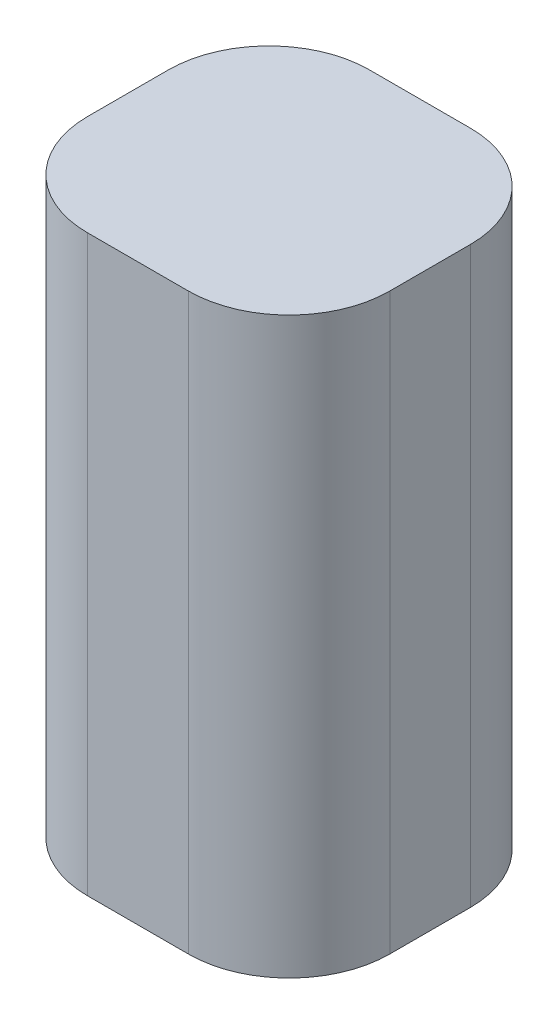
ISO-10303-21;
HEADER;
FILE_DESCRIPTION(('STEP AP214'),'2;1');
FILE_NAME('part.step','',(''),(''),'','','');
FILE_SCHEMA(('AUTOMOTIVE_DESIGN { 1 0 10303 214 1 1 1 1 }'));
ENDSEC;
DATA;
#1=APPLICATION_CONTEXT('core data for automotive mechanical design processes');
#2=APPLICATION_PROTOCOL_DEFINITION('international standard','automotive_design',2000,#1);
#3=PRODUCT_CONTEXT('',#1,'mechanical');
#4=PRODUCT('Part','Part','',(#3));
#5=PRODUCT_RELATED_PRODUCT_CATEGORY('part','',(#4));
#6=PRODUCT_DEFINITION_FORMATION('','',#4);
#7=PRODUCT_DEFINITION_CONTEXT('part definition',#1,'design');
#8=PRODUCT_DEFINITION('design','',#6,#7);
#9=PRODUCT_DEFINITION_SHAPE('','',#8);
#10=(LENGTH_UNIT() NAMED_UNIT(*) SI_UNIT(.MILLI.,.METRE.));
#11=(NAMED_UNIT(*) PLANE_ANGLE_UNIT() SI_UNIT($,.RADIAN.));
#12=(NAMED_UNIT(*) SI_UNIT($,.STERADIAN.) SOLID_ANGLE_UNIT());
#13=UNCERTAINTY_MEASURE_WITH_UNIT(LENGTH_MEASURE(1.E-05),#10,'distance_accuracy_value','');
#14=(GEOMETRIC_REPRESENTATION_CONTEXT(3) GLOBAL_UNCERTAINTY_ASSIGNED_CONTEXT((#13)) GLOBAL_UNIT_ASSIGNED_CONTEXT((#10,
#11,#12)) REPRESENTATION_CONTEXT('',''));
#15=CARTESIAN_POINT('',(0.,0.,0.));
#16=DIRECTION('',(0.,0.,1.));
#17=DIRECTION('',(1.,0.,0.));
#18=AXIS2_PLACEMENT_3D('',#15,#16,#17);
#19=CARTESIAN_POINT('',(15.,-28.5,28.));
#20=DIRECTION('',(-1.,0.,0.));
#21=DIRECTION('',(0.,0.,1.));
#22=AXIS2_PLACEMENT_3D('',#19,#20,#21);
#23=PLANE('',#22);
#24=DIRECTION('',(0.,0.,-1.));
#25=VECTOR('',#24,1.);
#26=CARTESIAN_POINT('',(15.,-28.5,28.));
#27=LINE('',#26,#25);
#28=CARTESIAN_POINT('',(15.,-28.5,18.));
#29=VERTEX_POINT('',#28);
#30=CARTESIAN_POINT('',(15.,-28.5,10.));
#31=VERTEX_POINT('',#30);
#32=EDGE_CURVE('E121',#29,#31,#27,.T.);
#33=ORIENTED_EDGE('',*,*,#32,.T.);
#34=DIRECTION('',(0.,1.,0.));
#35=VECTOR('',#34,1.);
#36=CARTESIAN_POINT('',(15.,28.5,10.));
#37=LINE('',#36,#35);
#38=CARTESIAN_POINT('',(15.,28.5,10.));
#39=VERTEX_POINT('',#38);
#40=EDGE_CURVE('E147',#31,#39,#37,.T.);
#41=ORIENTED_EDGE('',*,*,#40,.T.);
#42=DIRECTION('',(0.,0.,-1.));
#43=VECTOR('',#42,1.);
#44=CARTESIAN_POINT('',(15.,28.5,28.));
#45=LINE('',#44,#43);
#46=CARTESIAN_POINT('',(15.,28.5,18.));
#47=VERTEX_POINT('',#46);
#48=EDGE_CURVE('E126',#47,#39,#45,.T.);
#49=ORIENTED_EDGE('',*,*,#48,.F.);
#50=DIRECTION('',(0.,1.,0.));
#51=VECTOR('',#50,1.);
#52=CARTESIAN_POINT('',(15.,-28.5,18.));
#53=LINE('',#52,#51);
#54=EDGE_CURVE('E145',#47,#29,#53,.F.);
#55=ORIENTED_EDGE('',*,*,#54,.T.);
#56=EDGE_LOOP('',(#33,#41,#49,#55));
#57=FACE_BOUND('',#56,.T.);
#58=ADVANCED_FACE('F33',(#57),#23,.F.);
#59=CARTESIAN_POINT('',(-15.,28.5,28.));
#60=DIRECTION('',(0.,-1.,0.));
#61=DIRECTION('',(0.,0.,-1.));
#62=AXIS2_PLACEMENT_3D('',#59,#60,#61);
#63=PLANE('',#62);
#64=DIRECTION('',(-1.,0.,0.));
#65=VECTOR('',#64,1.);
#66=CARTESIAN_POINT('',(-15.,28.5,0.));
#67=LINE('',#66,#65);
#68=CARTESIAN_POINT('',(5.,28.5,0.));
#69=VERTEX_POINT('',#68);
#70=CARTESIAN_POINT('',(-5.,28.5,0.));
#71=VERTEX_POINT('',#70);
#72=EDGE_CURVE('E162',#69,#71,#67,.T.);
#73=ORIENTED_EDGE('',*,*,#72,.T.);
#74=CARTESIAN_POINT('',(-5.,28.5,10.));
#75=DIRECTION('',(0.,-1.,0.));
#76=DIRECTION('',(0.,0.,-1.));
#77=AXIS2_PLACEMENT_3D('',#74,#75,#76);
#78=CIRCLE('',#77,10.);
#79=CARTESIAN_POINT('',(-15.,28.5,10.));
#80=VERTEX_POINT('',#79);
#81=EDGE_CURVE('E143',#71,#80,#78,.F.);
#82=ORIENTED_EDGE('',*,*,#81,.T.);
#83=DIRECTION('',(0.,0.,-1.));
#84=VECTOR('',#83,1.);
#85=CARTESIAN_POINT('',(-15.,28.5,28.));
#86=LINE('',#85,#84);
#87=CARTESIAN_POINT('',(-15.,28.5,18.));
#88=VERTEX_POINT('',#87);
#89=EDGE_CURVE('E120',#88,#80,#86,.T.);
#90=ORIENTED_EDGE('',*,*,#89,.F.);
#91=CARTESIAN_POINT('',(-5.,28.5,18.));
#92=DIRECTION('',(0.,-1.,0.));
#93=DIRECTION('',(0.,0.,-1.));
#94=AXIS2_PLACEMENT_3D('',#91,#92,#93);
#95=CIRCLE('',#94,10.);
#96=CARTESIAN_POINT('',(-5.,28.5,28.));
#97=VERTEX_POINT('',#96);
#98=EDGE_CURVE('E125',#88,#97,#95,.F.);
#99=ORIENTED_EDGE('',*,*,#98,.T.);
#100=DIRECTION('',(-1.,0.,0.));
#101=VECTOR('',#100,1.);
#102=CARTESIAN_POINT('',(-15.,28.5,28.));
#103=LINE('',#102,#101);
#104=CARTESIAN_POINT('',(5.,28.5,28.));
#105=VERTEX_POINT('',#104);
#106=EDGE_CURVE('E153',#105,#97,#103,.T.);
#107=ORIENTED_EDGE('',*,*,#106,.F.);
#108=CARTESIAN_POINT('',(5.,28.5,18.));
#109=DIRECTION('',(0.,-1.,0.));
#110=DIRECTION('',(0.,0.,-1.));
#111=AXIS2_PLACEMENT_3D('',#108,#109,#110);
#112=CIRCLE('',#111,10.);
#113=EDGE_CURVE('E56',#105,#47,#112,.F.);
#114=ORIENTED_EDGE('',*,*,#113,.T.);
#115=ORIENTED_EDGE('',*,*,#48,.T.);
#116=CARTESIAN_POINT('',(5.,28.5,10.));
#117=DIRECTION('',(0.,-1.,0.));
#118=DIRECTION('',(0.,0.,-1.));
#119=AXIS2_PLACEMENT_3D('',#116,#117,#118);
#120=CIRCLE('',#119,10.);
#121=EDGE_CURVE('E48',#39,#69,#120,.F.);
#122=ORIENTED_EDGE('',*,*,#121,.T.);
#123=EDGE_LOOP('',(#73,#82,#90,#99,#107,#114,#115,#122));
#124=FACE_BOUND('',#123,.T.);
#125=ADVANCED_FACE('F157',(#124),#63,.F.);
#126=CARTESIAN_POINT('',(-15.,-28.5,28.));
#127=DIRECTION('',(1.,0.,0.));
#128=DIRECTION('',(0.,0.,-1.));
#129=AXIS2_PLACEMENT_3D('',#126,#127,#128);
#130=PLANE('',#129);
#131=ORIENTED_EDGE('',*,*,#89,.T.);
#132=DIRECTION('',(0.,-1.,0.));
#133=VECTOR('',#132,1.);
#134=CARTESIAN_POINT('',(-15.,-28.5,10.));
#135=LINE('',#134,#133);
#136=CARTESIAN_POINT('',(-15.,-28.5,10.));
#137=VERTEX_POINT('',#136);
#138=EDGE_CURVE('E119',#80,#137,#135,.T.);
#139=ORIENTED_EDGE('',*,*,#138,.T.);
#140=DIRECTION('',(0.,0.,-1.));
#141=VECTOR('',#140,1.);
#142=CARTESIAN_POINT('',(-15.,-28.5,28.));
#143=LINE('',#142,#141);
#144=CARTESIAN_POINT('',(-15.,-28.5,18.));
#145=VERTEX_POINT('',#144);
#146=EDGE_CURVE('E103',#145,#137,#143,.T.);
#147=ORIENTED_EDGE('',*,*,#146,.F.);
#148=DIRECTION('',(0.,-1.,0.));
#149=VECTOR('',#148,1.);
#150=CARTESIAN_POINT('',(-15.,-28.5,18.));
#151=LINE('',#150,#149);
#152=EDGE_CURVE('E116',#145,#88,#151,.F.);
#153=ORIENTED_EDGE('',*,*,#152,.T.);
#154=EDGE_LOOP('',(#131,#139,#147,#153));
#155=FACE_BOUND('',#154,.T.);
#156=ADVANCED_FACE('F115',(#155),#130,.F.);
#157=CARTESIAN_POINT('',(-15.,-28.5,28.));
#158=DIRECTION('',(0.,1.,0.));
#159=DIRECTION('',(0.,0.,1.));
#160=AXIS2_PLACEMENT_3D('',#157,#158,#159);
#161=PLANE('',#160);
#162=ORIENTED_EDGE('',*,*,#146,.T.);
#163=CARTESIAN_POINT('',(-5.,-28.5,10.));
#164=DIRECTION('',(0.,1.,0.));
#165=DIRECTION('',(0.,0.,1.));
#166=AXIS2_PLACEMENT_3D('',#163,#164,#165);
#167=CIRCLE('',#166,10.);
#168=CARTESIAN_POINT('',(-5.,-28.5,0.));
#169=VERTEX_POINT('',#168);
#170=EDGE_CURVE('E134',#137,#169,#167,.F.);
#171=ORIENTED_EDGE('',*,*,#170,.T.);
#172=DIRECTION('',(1.,0.,0.));
#173=VECTOR('',#172,1.);
#174=CARTESIAN_POINT('',(-15.,-28.5,0.));
#175=LINE('',#174,#173);
#176=CARTESIAN_POINT('',(5.,-28.5,0.));
#177=VERTEX_POINT('',#176);
#178=EDGE_CURVE('E158',#169,#177,#175,.T.);
#179=ORIENTED_EDGE('',*,*,#178,.T.);
#180=CARTESIAN_POINT('',(5.,-28.5,10.));
#181=DIRECTION('',(0.,1.,0.));
#182=DIRECTION('',(0.,0.,1.));
#183=AXIS2_PLACEMENT_3D('',#180,#181,#182);
#184=CIRCLE('',#183,10.);
#185=EDGE_CURVE('E109',#177,#31,#184,.F.);
#186=ORIENTED_EDGE('',*,*,#185,.T.);
#187=ORIENTED_EDGE('',*,*,#32,.F.);
#188=CARTESIAN_POINT('',(5.,-28.5,18.));
#189=DIRECTION('',(0.,1.,0.));
#190=DIRECTION('',(0.,0.,1.));
#191=AXIS2_PLACEMENT_3D('',#188,#189,#190);
#192=CIRCLE('',#191,10.);
#193=CARTESIAN_POINT('',(5.,-28.5,28.));
#194=VERTEX_POINT('',#193);
#195=EDGE_CURVE('E110',#29,#194,#192,.F.);
#196=ORIENTED_EDGE('',*,*,#195,.T.);
#197=DIRECTION('',(1.,0.,0.));
#198=VECTOR('',#197,1.);
#199=CARTESIAN_POINT('',(-15.,-28.5,28.));
#200=LINE('',#199,#198);
#201=CARTESIAN_POINT('',(-5.,-28.5,28.));
#202=VERTEX_POINT('',#201);
#203=EDGE_CURVE('E105',#202,#194,#200,.T.);
#204=ORIENTED_EDGE('',*,*,#203,.F.);
#205=CARTESIAN_POINT('',(-5.,-28.5,18.));
#206=DIRECTION('',(0.,1.,0.));
#207=DIRECTION('',(0.,0.,1.));
#208=AXIS2_PLACEMENT_3D('',#205,#206,#207);
#209=CIRCLE('',#208,10.);
#210=EDGE_CURVE('E100',#202,#145,#209,.F.);
#211=ORIENTED_EDGE('',*,*,#210,.T.);
#212=EDGE_LOOP('',(#162,#171,#179,#186,#187,#196,#204,#211));
#213=FACE_BOUND('',#212,.T.);
#214=ADVANCED_FACE('F102',(#213),#161,.F.);
#215=CARTESIAN_POINT('',(15.,28.5,28.));
#216=DIRECTION('',(0.,0.,-1.));
#217=DIRECTION('',(-1.,0.,0.));
#218=AXIS2_PLACEMENT_3D('',#215,#216,#217);
#219=PLANE('',#218);
#220=ORIENTED_EDGE('',*,*,#106,.T.);
#221=DIRECTION('',(0.,-1.,0.));
#222=VECTOR('',#221,1.);
#223=CARTESIAN_POINT('',(-5.,28.5,28.));
#224=LINE('',#223,#222);
#225=EDGE_CURVE('E11',#97,#202,#224,.T.);
#226=ORIENTED_EDGE('',*,*,#225,.T.);
#227=ORIENTED_EDGE('',*,*,#203,.T.);
#228=DIRECTION('',(0.,1.,0.));
#229=VECTOR('',#228,1.);
#230=CARTESIAN_POINT('',(5.,28.5,28.));
#231=LINE('',#230,#229);
#232=EDGE_CURVE('E41',#194,#105,#231,.T.);
#233=ORIENTED_EDGE('',*,*,#232,.T.);
#234=EDGE_LOOP('',(#220,#226,#227,#233));
#235=FACE_BOUND('',#234,.T.);
#236=ADVANCED_FACE('F152',(#235),#219,.F.);
#237=CARTESIAN_POINT('',(15.,28.5,0.));
#238=DIRECTION('',(0.,0.,-1.));
#239=DIRECTION('',(-1.,0.,0.));
#240=AXIS2_PLACEMENT_3D('',#237,#238,#239);
#241=PLANE('',#240);
#242=ORIENTED_EDGE('',*,*,#178,.F.);
#243=DIRECTION('',(0.,-1.,0.));
#244=VECTOR('',#243,1.);
#245=CARTESIAN_POINT('',(-5.,28.5,0.));
#246=LINE('',#245,#244);
#247=EDGE_CURVE('E138',#169,#71,#246,.F.);
#248=ORIENTED_EDGE('',*,*,#247,.T.);
#249=ORIENTED_EDGE('',*,*,#72,.F.);
#250=DIRECTION('',(0.,1.,0.));
#251=VECTOR('',#250,1.);
#252=CARTESIAN_POINT('',(5.,-28.5,0.));
#253=LINE('',#252,#251);
#254=EDGE_CURVE('E136',#69,#177,#253,.F.);
#255=ORIENTED_EDGE('',*,*,#254,.T.);
#256=EDGE_LOOP('',(#242,#248,#249,#255));
#257=FACE_BOUND('',#256,.T.);
#258=ADVANCED_FACE('F174',(#257),#241,.T.);
#259=CARTESIAN_POINT('',(-5.,-28.5,10.));
#260=DIRECTION('',(0.,1.,0.));
#261=DIRECTION('',(0.,0.,1.));
#262=AXIS2_PLACEMENT_3D('',#259,#260,#261);
#263=CYLINDRICAL_SURFACE('',#262,10.);
#264=ORIENTED_EDGE('',*,*,#81,.F.);
#265=ORIENTED_EDGE('',*,*,#247,.F.);
#266=ORIENTED_EDGE('',*,*,#170,.F.);
#267=ORIENTED_EDGE('',*,*,#138,.F.);
#268=EDGE_LOOP('',(#264,#265,#266,#267));
#269=FACE_BOUND('',#268,.T.);
#270=ADVANCED_FACE('F169',(#269),#263,.T.);
#271=CARTESIAN_POINT('',(5.,-28.5,10.));
#272=DIRECTION('',(0.,-1.,0.));
#273=DIRECTION('',(0.,0.,-1.));
#274=AXIS2_PLACEMENT_3D('',#271,#272,#273);
#275=CYLINDRICAL_SURFACE('',#274,10.);
#276=ORIENTED_EDGE('',*,*,#185,.F.);
#277=ORIENTED_EDGE('',*,*,#254,.F.);
#278=ORIENTED_EDGE('',*,*,#121,.F.);
#279=ORIENTED_EDGE('',*,*,#40,.F.);
#280=EDGE_LOOP('',(#276,#277,#278,#279));
#281=FACE_BOUND('',#280,.T.);
#282=ADVANCED_FACE('F176',(#281),#275,.T.);
#283=CARTESIAN_POINT('',(-5.,28.5,18.));
#284=DIRECTION('',(0.,-1.,0.));
#285=DIRECTION('',(0.,0.,-1.));
#286=AXIS2_PLACEMENT_3D('',#283,#284,#285);
#287=CYLINDRICAL_SURFACE('',#286,10.);
#288=ORIENTED_EDGE('',*,*,#98,.F.);
#289=ORIENTED_EDGE('',*,*,#152,.F.);
#290=ORIENTED_EDGE('',*,*,#210,.F.);
#291=ORIENTED_EDGE('',*,*,#225,.F.);
#292=EDGE_LOOP('',(#288,#289,#290,#291));
#293=FACE_BOUND('',#292,.T.);
#294=ADVANCED_FACE('F124',(#293),#287,.T.);
#295=CARTESIAN_POINT('',(5.,28.5,18.));
#296=DIRECTION('',(0.,1.,0.));
#297=DIRECTION('',(0.,0.,1.));
#298=AXIS2_PLACEMENT_3D('',#295,#296,#297);
#299=CYLINDRICAL_SURFACE('',#298,10.);
#300=ORIENTED_EDGE('',*,*,#195,.F.);
#301=ORIENTED_EDGE('',*,*,#54,.F.);
#302=ORIENTED_EDGE('',*,*,#113,.F.);
#303=ORIENTED_EDGE('',*,*,#232,.F.);
#304=EDGE_LOOP('',(#300,#301,#302,#303));
#305=FACE_BOUND('',#304,.T.);
#306=ADVANCED_FACE('F35',(#305),#299,.T.);
#307=CLOSED_SHELL('',(#58,#125,#156,#214,#236,#258,#270,#282,#294,#306));
#308=MANIFOLD_SOLID_BREP('B2',#307);
#309=ADVANCED_BREP_SHAPE_REPRESENTATION('',(#18,#308),#14);
#310=SHAPE_DEFINITION_REPRESENTATION(#9,#309);
ENDSEC;
END-ISO-10303-21;
